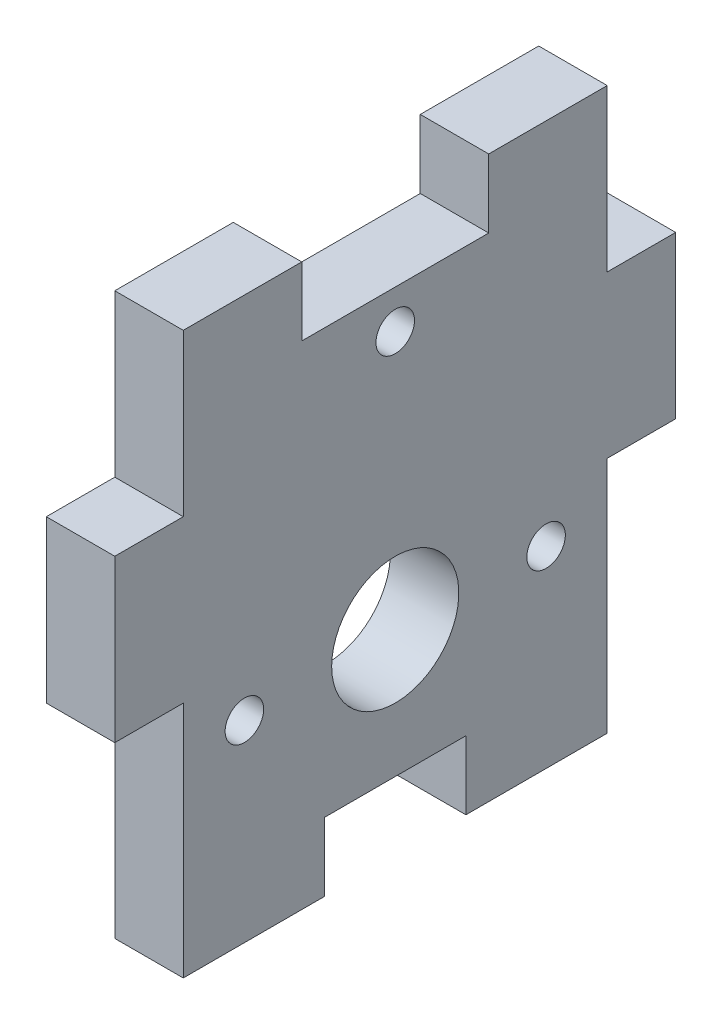
ISO-10303-21;
HEADER;
FILE_DESCRIPTION(('STEP AP214'),'2;1');
FILE_NAME('part.step','',(''),(''),'','','');
FILE_SCHEMA(('AUTOMOTIVE_DESIGN { 1 0 10303 214 1 1 1 1 }'));
ENDSEC;
DATA;
#1=APPLICATION_CONTEXT('core data for automotive mechanical design processes');
#2=APPLICATION_PROTOCOL_DEFINITION('international standard','automotive_design',2000,#1);
#3=PRODUCT_CONTEXT('',#1,'mechanical');
#4=PRODUCT('Part','Part','',(#3));
#5=PRODUCT_RELATED_PRODUCT_CATEGORY('part','',(#4));
#6=PRODUCT_DEFINITION_FORMATION('','',#4);
#7=PRODUCT_DEFINITION_CONTEXT('part definition',#1,'design');
#8=PRODUCT_DEFINITION('design','',#6,#7);
#9=PRODUCT_DEFINITION_SHAPE('','',#8);
#10=(LENGTH_UNIT() NAMED_UNIT(*) SI_UNIT(.MILLI.,.METRE.));
#11=(NAMED_UNIT(*) PLANE_ANGLE_UNIT() SI_UNIT($,.RADIAN.));
#12=(NAMED_UNIT(*) SI_UNIT($,.STERADIAN.) SOLID_ANGLE_UNIT());
#13=UNCERTAINTY_MEASURE_WITH_UNIT(LENGTH_MEASURE(1.E-05),#10,'distance_accuracy_value','');
#14=(GEOMETRIC_REPRESENTATION_CONTEXT(3) GLOBAL_UNCERTAINTY_ASSIGNED_CONTEXT((#13)) GLOBAL_UNIT_ASSIGNED_CONTEXT((#10,
#11,#12)) REPRESENTATION_CONTEXT('',''));
#15=CARTESIAN_POINT('',(0.,0.,0.));
#16=DIRECTION('',(0.,0.,1.));
#17=DIRECTION('',(1.,0.,0.));
#18=AXIS2_PLACEMENT_3D('',#15,#16,#17);
#19=CARTESIAN_POINT('',(5.334,16.51,-16.51));
#20=DIRECTION('',(-1.,0.,0.));
#21=DIRECTION('',(0.,0.,1.));
#22=AXIS2_PLACEMENT_3D('',#19,#20,#21);
#23=PLANE('',#22);
#24=CARTESIAN_POINT('',(5.334,-6.84159698893422,-11.75));
#25=DIRECTION('',(-1.,0.,0.));
#26=DIRECTION('',(0.,0.,1.));
#27=AXIS2_PLACEMENT_3D('',#24,#25,#26);
#28=CIRCLE('',#27,1.50000000000001);
#29=CARTESIAN_POINT('',(5.334,-6.84159698893422,-10.2499999999999));
#30=VERTEX_POINT('',#29);
#31=EDGE_CURVE('E540',#30,#30,#28,.T.);
#32=ORIENTED_EDGE('',*,*,#31,.T.);
#33=EDGE_LOOP('',(#32));
#34=FACE_BOUND('',#33,.T.);
#35=CARTESIAN_POINT('',(5.334,-6.60399999999996,0.));
#36=DIRECTION('',(-1.,0.,0.));
#37=DIRECTION('',(0.,0.,1.));
#38=AXIS2_PLACEMENT_3D('',#35,#36,#37);
#39=CIRCLE('',#38,4.95300000000001);
#40=CARTESIAN_POINT('',(5.334,-6.60399999999996,4.95300000000006));
#41=VERTEX_POINT('',#40);
#42=EDGE_CURVE('E544',#41,#41,#39,.T.);
#43=ORIENTED_EDGE('',*,*,#42,.T.);
#44=EDGE_LOOP('',(#43));
#45=FACE_BOUND('',#44,.T.);
#46=CARTESIAN_POINT('',(5.334,-6.84159698893422,11.7500000000001));
#47=DIRECTION('',(-1.,0.,0.));
#48=DIRECTION('',(0.,0.,1.));
#49=AXIS2_PLACEMENT_3D('',#46,#47,#48);
#50=CIRCLE('',#49,1.50000000000001);
#51=CARTESIAN_POINT('',(5.334,-6.84159698893422,13.2500000000001));
#52=VERTEX_POINT('',#51);
#53=EDGE_CURVE('E553',#52,#52,#50,.T.);
#54=ORIENTED_EDGE('',*,*,#53,.T.);
#55=EDGE_LOOP('',(#54));
#56=FACE_BOUND('',#55,.T.);
#57=CARTESIAN_POINT('',(5.334,13.5100000000001,0.));
#58=DIRECTION('',(-1.,0.,0.));
#59=DIRECTION('',(0.,0.,1.));
#60=AXIS2_PLACEMENT_3D('',#57,#58,#59);
#61=CIRCLE('',#60,1.50000000000001);
#62=CARTESIAN_POINT('',(5.334,13.5100000000001,1.50000000000005));
#63=VERTEX_POINT('',#62);
#64=EDGE_CURVE('E231',#63,#63,#61,.T.);
#65=ORIENTED_EDGE('',*,*,#64,.T.);
#66=EDGE_LOOP('',(#65));
#67=FACE_BOUND('',#66,.T.);
#68=DIRECTION('',(0.,0.,-1.));
#69=VECTOR('',#68,1.);
#70=CARTESIAN_POINT('',(5.33400000000003,16.51,7.28133333333334));
#71=LINE('',#70,#69);
#72=CARTESIAN_POINT('',(5.33400000000003,16.51,7.28133333333334));
#73=VERTEX_POINT('',#72);
#74=CARTESIAN_POINT('',(5.33400000000002,16.51,-7.28133333333333));
#75=VERTEX_POINT('',#74);
#76=EDGE_CURVE('E274',#73,#75,#71,.T.);
#77=ORIENTED_EDGE('',*,*,#76,.F.);
#78=DIRECTION('',(0.,1.,0.));
#79=VECTOR('',#78,1.);
#80=CARTESIAN_POINT('',(5.33400000000003,16.51,7.28133333333334));
#81=LINE('',#80,#79);
#82=CARTESIAN_POINT('',(5.33400000000003,21.844,7.28133333333334));
#83=VERTEX_POINT('',#82);
#84=EDGE_CURVE('E299',#73,#83,#81,.T.);
#85=ORIENTED_EDGE('',*,*,#84,.T.);
#86=DIRECTION('',(0.,0.,1.));
#87=VECTOR('',#86,1.);
#88=CARTESIAN_POINT('',(5.334,21.844,-48.1982213562373));
#89=LINE('',#88,#87);
#90=CARTESIAN_POINT('',(5.334,21.844,16.51));
#91=VERTEX_POINT('',#90);
#92=EDGE_CURVE('E370',#83,#91,#89,.T.);
#93=ORIENTED_EDGE('',*,*,#92,.T.);
#94=DIRECTION('',(0.,1.,0.));
#95=VECTOR('',#94,1.);
#96=CARTESIAN_POINT('',(5.334,-15.875,16.51));
#97=LINE('',#96,#95);
#98=CARTESIAN_POINT('',(5.334,9.271,16.51));
#99=VERTEX_POINT('',#98);
#100=EDGE_CURVE('E89',#99,#91,#97,.T.);
#101=ORIENTED_EDGE('',*,*,#100,.F.);
#102=DIRECTION('',(0.,0.,1.));
#103=VECTOR('',#102,1.);
#104=CARTESIAN_POINT('',(5.334,9.271,16.51));
#105=LINE('',#104,#103);
#106=CARTESIAN_POINT('',(5.334,9.271,21.844));
#107=VERTEX_POINT('',#106);
#108=EDGE_CURVE('E238',#99,#107,#105,.T.);
#109=ORIENTED_EDGE('',*,*,#108,.T.);
#110=DIRECTION('',(0.,1.,0.));
#111=VECTOR('',#110,1.);
#112=CARTESIAN_POINT('',(5.334,0.,21.844));
#113=LINE('',#112,#111);
#114=CARTESIAN_POINT('',(5.334,-3.302,21.844));
#115=VERTEX_POINT('',#114);
#116=EDGE_CURVE('E237',#115,#107,#113,.T.);
#117=ORIENTED_EDGE('',*,*,#116,.F.);
#118=DIRECTION('',(0.,0.,-1.));
#119=VECTOR('',#118,1.);
#120=CARTESIAN_POINT('',(5.334,-3.302,16.51));
#121=LINE('',#120,#119);
#122=CARTESIAN_POINT('',(5.334,-3.302,16.51));
#123=VERTEX_POINT('',#122);
#124=EDGE_CURVE('E226',#115,#123,#121,.T.);
#125=ORIENTED_EDGE('',*,*,#124,.T.);
#126=DIRECTION('',(0.,-1.,0.));
#127=VECTOR('',#126,1.);
#128=CARTESIAN_POINT('',(5.334,0.,16.51));
#129=LINE('',#128,#127);
#130=CARTESIAN_POINT('',(5.334,-21.844,16.51));
#131=VERTEX_POINT('',#130);
#132=EDGE_CURVE('E210',#123,#131,#129,.T.);
#133=ORIENTED_EDGE('',*,*,#132,.T.);
#134=DIRECTION('',(0.,0.,-1.));
#135=VECTOR('',#134,1.);
#136=CARTESIAN_POINT('',(5.334,-21.844,-48.1982213562373));
#137=LINE('',#136,#135);
#138=CARTESIAN_POINT('',(5.334,-21.844,5.50333333333335));
#139=VERTEX_POINT('',#138);
#140=EDGE_CURVE('E330',#131,#139,#137,.T.);
#141=ORIENTED_EDGE('',*,*,#140,.T.);
#142=DIRECTION('',(0.,-1.,0.));
#143=VECTOR('',#142,1.);
#144=CARTESIAN_POINT('',(5.334,-21.844,5.50333333333335));
#145=LINE('',#144,#143);
#146=CARTESIAN_POINT('',(5.334,-16.51,5.50333333333335));
#147=VERTEX_POINT('',#146);
#148=EDGE_CURVE('E307',#147,#139,#145,.T.);
#149=ORIENTED_EDGE('',*,*,#148,.F.);
#150=DIRECTION('',(0.,0.,1.));
#151=VECTOR('',#150,1.);
#152=CARTESIAN_POINT('',(5.334,-16.51,5.50333333333335));
#153=LINE('',#152,#151);
#154=CARTESIAN_POINT('',(5.334,-16.51,-5.50333333333332));
#155=VERTEX_POINT('',#154);
#156=EDGE_CURVE('E312',#155,#147,#153,.T.);
#157=ORIENTED_EDGE('',*,*,#156,.F.);
#158=DIRECTION('',(0.,1.,0.));
#159=VECTOR('',#158,1.);
#160=CARTESIAN_POINT('',(5.334,-21.844,-5.50333333333332));
#161=LINE('',#160,#159);
#162=CARTESIAN_POINT('',(5.334,-21.844,-5.50333333333332));
#163=VERTEX_POINT('',#162);
#164=EDGE_CURVE('E309',#163,#155,#161,.T.);
#165=ORIENTED_EDGE('',*,*,#164,.F.);
#166=CARTESIAN_POINT('',(5.334,-21.844,-16.51));
#167=VERTEX_POINT('',#166);
#168=EDGE_CURVE('E220',#163,#167,#137,.T.);
#169=ORIENTED_EDGE('',*,*,#168,.T.);
#170=DIRECTION('',(0.,-1.,0.));
#171=VECTOR('',#170,1.);
#172=CARTESIAN_POINT('',(5.334,0.,-16.51));
#173=LINE('',#172,#171);
#174=CARTESIAN_POINT('',(5.33399999999999,-3.30200000000001,-16.51));
#175=VERTEX_POINT('',#174);
#176=EDGE_CURVE('E323',#175,#167,#173,.T.);
#177=ORIENTED_EDGE('',*,*,#176,.F.);
#178=DIRECTION('',(0.,0.,-1.));
#179=VECTOR('',#178,1.);
#180=CARTESIAN_POINT('',(5.33399999999999,-3.30200000000001,-21.844));
#181=LINE('',#180,#179);
#182=CARTESIAN_POINT('',(5.33399999999999,-3.30200000000001,-21.844));
#183=VERTEX_POINT('',#182);
#184=EDGE_CURVE('E267',#175,#183,#181,.T.);
#185=ORIENTED_EDGE('',*,*,#184,.T.);
#186=DIRECTION('',(0.,-1.,0.));
#187=VECTOR('',#186,1.);
#188=CARTESIAN_POINT('',(5.334,0.,-21.844));
#189=LINE('',#188,#187);
#190=CARTESIAN_POINT('',(5.334,9.27099999999999,-21.844));
#191=VERTEX_POINT('',#190);
#192=EDGE_CURVE('E332',#191,#183,#189,.T.);
#193=ORIENTED_EDGE('',*,*,#192,.F.);
#194=DIRECTION('',(0.,0.,1.));
#195=VECTOR('',#194,1.);
#196=CARTESIAN_POINT('',(5.33399999999999,9.27099999999999,-21.844));
#197=LINE('',#196,#195);
#198=CARTESIAN_POINT('',(5.33399999999999,9.27099999999999,-16.51));
#199=VERTEX_POINT('',#198);
#200=EDGE_CURVE('E270',#191,#199,#197,.T.);
#201=ORIENTED_EDGE('',*,*,#200,.T.);
#202=DIRECTION('',(0.,1.,0.));
#203=VECTOR('',#202,1.);
#204=CARTESIAN_POINT('',(5.33399999999999,-15.875,-16.51));
#205=LINE('',#204,#203);
#206=CARTESIAN_POINT('',(5.33399999999998,21.844,-16.51));
#207=VERTEX_POINT('',#206);
#208=EDGE_CURVE('E261',#199,#207,#205,.T.);
#209=ORIENTED_EDGE('',*,*,#208,.T.);
#210=CARTESIAN_POINT('',(5.334,21.844,-7.28133333333333));
#211=VERTEX_POINT('',#210);
#212=EDGE_CURVE('E369',#207,#211,#89,.T.);
#213=ORIENTED_EDGE('',*,*,#212,.T.);
#214=DIRECTION('',(0.,1.,0.));
#215=VECTOR('',#214,1.);
#216=CARTESIAN_POINT('',(5.33400000000002,16.51,-7.28133333333333));
#217=LINE('',#216,#215);
#218=EDGE_CURVE('E97',#75,#211,#217,.T.);
#219=ORIENTED_EDGE('',*,*,#218,.F.);
#220=EDGE_LOOP('',(#77,#85,#93,#101,#109,#117,#125,#133,#141,#149,#157,#165,#169,#177,#185,#193,
#201,#209,#213,#219));
#221=FACE_BOUND('',#220,.T.);
#222=ADVANCED_FACE('F73',(#34,#45,#56,#67,#221),#23,.F.);
#223=CARTESIAN_POINT('',(0.,16.51,-16.51));
#224=DIRECTION('',(-1.,0.,0.));
#225=DIRECTION('',(0.,0.,1.));
#226=AXIS2_PLACEMENT_3D('',#223,#224,#225);
#227=PLANE('',#226);
#228=CARTESIAN_POINT('',(0.,-6.84159698893422,-11.75));
#229=DIRECTION('',(-1.,0.,0.));
#230=DIRECTION('',(0.,0.,1.));
#231=AXIS2_PLACEMENT_3D('',#228,#229,#230);
#232=CIRCLE('',#231,1.50000000000001);
#233=CARTESIAN_POINT('',(0.,-6.84159698893422,-10.2499999999999));
#234=VERTEX_POINT('',#233);
#235=EDGE_CURVE('E538',#234,#234,#232,.T.);
#236=ORIENTED_EDGE('',*,*,#235,.F.);
#237=EDGE_LOOP('',(#236));
#238=FACE_BOUND('',#237,.T.);
#239=CARTESIAN_POINT('',(0.,-6.60399999999996,0.));
#240=DIRECTION('',(-1.,0.,0.));
#241=DIRECTION('',(0.,0.,1.));
#242=AXIS2_PLACEMENT_3D('',#239,#240,#241);
#243=CIRCLE('',#242,4.95300000000001);
#244=CARTESIAN_POINT('',(0.,-6.60399999999996,4.95300000000006));
#245=VERTEX_POINT('',#244);
#246=EDGE_CURVE('E541',#245,#245,#243,.T.);
#247=ORIENTED_EDGE('',*,*,#246,.F.);
#248=EDGE_LOOP('',(#247));
#249=FACE_BOUND('',#248,.T.);
#250=CARTESIAN_POINT('',(0.,-6.84159698893422,11.7500000000001));
#251=DIRECTION('',(-1.,0.,0.));
#252=DIRECTION('',(0.,0.,1.));
#253=AXIS2_PLACEMENT_3D('',#250,#251,#252);
#254=CIRCLE('',#253,1.50000000000001);
#255=CARTESIAN_POINT('',(0.,-6.84159698893422,13.2500000000001));
#256=VERTEX_POINT('',#255);
#257=EDGE_CURVE('E550',#256,#256,#254,.T.);
#258=ORIENTED_EDGE('',*,*,#257,.F.);
#259=EDGE_LOOP('',(#258));
#260=FACE_BOUND('',#259,.T.);
#261=CARTESIAN_POINT('',(0.,13.5100000000001,0.));
#262=DIRECTION('',(-1.,0.,0.));
#263=DIRECTION('',(0.,0.,1.));
#264=AXIS2_PLACEMENT_3D('',#261,#262,#263);
#265=CIRCLE('',#264,1.50000000000001);
#266=CARTESIAN_POINT('',(0.,13.5100000000001,1.50000000000005));
#267=VERTEX_POINT('',#266);
#268=EDGE_CURVE('E556',#267,#267,#265,.T.);
#269=ORIENTED_EDGE('',*,*,#268,.F.);
#270=EDGE_LOOP('',(#269));
#271=FACE_BOUND('',#270,.T.);
#272=DIRECTION('',(0.,1.,0.));
#273=VECTOR('',#272,1.);
#274=CARTESIAN_POINT('',(0.,0.,21.844));
#275=LINE('',#274,#273);
#276=CARTESIAN_POINT('',(0.,-3.30200000000001,21.844));
#277=VERTEX_POINT('',#276);
#278=CARTESIAN_POINT('',(0.,9.27099999999999,21.844));
#279=VERTEX_POINT('',#278);
#280=EDGE_CURVE('E342',#277,#279,#275,.T.);
#281=ORIENTED_EDGE('',*,*,#280,.T.);
#282=DIRECTION('',(0.,0.,-1.));
#283=VECTOR('',#282,1.);
#284=CARTESIAN_POINT('',(0.,9.27099999999999,21.84405));
#285=LINE('',#284,#283);
#286=CARTESIAN_POINT('',(0.,9.27099999999999,16.51));
#287=VERTEX_POINT('',#286);
#288=EDGE_CURVE('E421',#279,#287,#285,.T.);
#289=ORIENTED_EDGE('',*,*,#288,.T.);
#290=DIRECTION('',(0.,-1.,0.));
#291=VECTOR('',#290,1.);
#292=CARTESIAN_POINT('',(0.,21.844,16.51));
#293=LINE('',#292,#291);
#294=CARTESIAN_POINT('',(0.,21.844,16.51));
#295=VERTEX_POINT('',#294);
#296=EDGE_CURVE('E287',#295,#287,#293,.T.);
#297=ORIENTED_EDGE('',*,*,#296,.F.);
#298=DIRECTION('',(0.,0.,1.));
#299=VECTOR('',#298,1.);
#300=CARTESIAN_POINT('',(0.,21.844,-48.1982213562373));
#301=LINE('',#300,#299);
#302=CARTESIAN_POINT('',(0.,21.844,7.28133333333334));
#303=VERTEX_POINT('',#302);
#304=EDGE_CURVE('E339',#303,#295,#301,.T.);
#305=ORIENTED_EDGE('',*,*,#304,.F.);
#306=DIRECTION('',(0.,1.,0.));
#307=VECTOR('',#306,1.);
#308=CARTESIAN_POINT('',(0.,16.51,7.28133333333334));
#309=LINE('',#308,#307);
#310=CARTESIAN_POINT('',(0.,16.51,7.28133333333334));
#311=VERTEX_POINT('',#310);
#312=EDGE_CURVE('E284',#311,#303,#309,.T.);
#313=ORIENTED_EDGE('',*,*,#312,.F.);
#314=DIRECTION('',(0.,0.,1.));
#315=VECTOR('',#314,1.);
#316=CARTESIAN_POINT('',(0.,16.51,-16.51));
#317=LINE('',#316,#315);
#318=CARTESIAN_POINT('',(0.,16.51,-7.28133333333333));
#319=VERTEX_POINT('',#318);
#320=EDGE_CURVE('E12',#319,#311,#317,.T.);
#321=ORIENTED_EDGE('',*,*,#320,.F.);
#322=DIRECTION('',(0.,1.,0.));
#323=VECTOR('',#322,1.);
#324=CARTESIAN_POINT('',(0.,16.51,-7.28133333333333));
#325=LINE('',#324,#323);
#326=CARTESIAN_POINT('',(0.,21.844,-7.28133333333333));
#327=VERTEX_POINT('',#326);
#328=EDGE_CURVE('E288',#319,#327,#325,.T.);
#329=ORIENTED_EDGE('',*,*,#328,.T.);
#330=CARTESIAN_POINT('',(0.,21.844,-16.51));
#331=VERTEX_POINT('',#330);
#332=EDGE_CURVE('E347',#331,#327,#301,.T.);
#333=ORIENTED_EDGE('',*,*,#332,.F.);
#334=DIRECTION('',(0.,1.,0.));
#335=VECTOR('',#334,1.);
#336=CARTESIAN_POINT('',(0.,16.51,-16.51));
#337=LINE('',#336,#335);
#338=CARTESIAN_POINT('',(0.,9.27099999999999,-16.51));
#339=VERTEX_POINT('',#338);
#340=EDGE_CURVE('E305',#339,#331,#337,.T.);
#341=ORIENTED_EDGE('',*,*,#340,.F.);
#342=DIRECTION('',(0.,0.,-1.));
#343=VECTOR('',#342,1.);
#344=CARTESIAN_POINT('',(0.,9.27099999999999,-16.50995));
#345=LINE('',#344,#343);
#346=CARTESIAN_POINT('',(0.,9.27099999999999,-21.844));
#347=VERTEX_POINT('',#346);
#348=EDGE_CURVE('E252',#339,#347,#345,.T.);
#349=ORIENTED_EDGE('',*,*,#348,.T.);
#350=DIRECTION('',(0.,-1.,0.));
#351=VECTOR('',#350,1.);
#352=CARTESIAN_POINT('',(0.,0.,-21.844));
#353=LINE('',#352,#351);
#354=CARTESIAN_POINT('',(0.,-3.30200000000001,-21.844));
#355=VERTEX_POINT('',#354);
#356=EDGE_CURVE('E336',#347,#355,#353,.T.);
#357=ORIENTED_EDGE('',*,*,#356,.T.);
#358=DIRECTION('',(0.,0.,-1.));
#359=VECTOR('',#358,1.);
#360=CARTESIAN_POINT('',(0.,-3.30200000000001,-16.50995));
#361=LINE('',#360,#359);
#362=CARTESIAN_POINT('',(0.,-3.30200000000001,-16.51));
#363=VERTEX_POINT('',#362);
#364=EDGE_CURVE('E251',#363,#355,#361,.T.);
#365=ORIENTED_EDGE('',*,*,#364,.F.);
#366=DIRECTION('',(0.,-1.,0.));
#367=VECTOR('',#366,1.);
#368=CARTESIAN_POINT('',(0.,0.,-16.51));
#369=LINE('',#368,#367);
#370=CARTESIAN_POINT('',(0.,-21.844,-16.51));
#371=VERTEX_POINT('',#370);
#372=EDGE_CURVE('E221',#363,#371,#369,.T.);
#373=ORIENTED_EDGE('',*,*,#372,.T.);
#374=DIRECTION('',(0.,0.,-1.));
#375=VECTOR('',#374,1.);
#376=CARTESIAN_POINT('',(0.,-21.844,-48.1982213562373));
#377=LINE('',#376,#375);
#378=CARTESIAN_POINT('',(0.,-21.844,-5.50333333333332));
#379=VERTEX_POINT('',#378);
#380=EDGE_CURVE('E335',#379,#371,#377,.T.);
#381=ORIENTED_EDGE('',*,*,#380,.F.);
#382=DIRECTION('',(0.,-1.,0.));
#383=VECTOR('',#382,1.);
#384=CARTESIAN_POINT('',(0.,16.51,-5.50333333333332));
#385=LINE('',#384,#383);
#386=CARTESIAN_POINT('',(0.,-16.51,-5.50333333333332));
#387=VERTEX_POINT('',#386);
#388=EDGE_CURVE('E318',#387,#379,#385,.T.);
#389=ORIENTED_EDGE('',*,*,#388,.F.);
#390=DIRECTION('',(0.,0.,-1.));
#391=VECTOR('',#390,1.);
#392=CARTESIAN_POINT('',(0.,-16.51,-16.51));
#393=LINE('',#392,#391);
#394=CARTESIAN_POINT('',(0.,-16.51,5.50333333333335));
#395=VERTEX_POINT('',#394);
#396=EDGE_CURVE('E82',#395,#387,#393,.T.);
#397=ORIENTED_EDGE('',*,*,#396,.F.);
#398=DIRECTION('',(0.,1.,0.));
#399=VECTOR('',#398,1.);
#400=CARTESIAN_POINT('',(0.,16.51,5.50333333333335));
#401=LINE('',#400,#399);
#402=CARTESIAN_POINT('',(0.,-21.844,5.50333333333335));
#403=VERTEX_POINT('',#402);
#404=EDGE_CURVE('E321',#403,#395,#401,.T.);
#405=ORIENTED_EDGE('',*,*,#404,.F.);
#406=CARTESIAN_POINT('',(0.,-21.844,16.51));
#407=VERTEX_POINT('',#406);
#408=EDGE_CURVE('E329',#407,#403,#377,.T.);
#409=ORIENTED_EDGE('',*,*,#408,.F.);
#410=DIRECTION('',(0.,-1.,0.));
#411=VECTOR('',#410,1.);
#412=CARTESIAN_POINT('',(0.,0.,16.51));
#413=LINE('',#412,#411);
#414=CARTESIAN_POINT('',(0.,-3.30200000000001,16.51));
#415=VERTEX_POINT('',#414);
#416=EDGE_CURVE('E325',#415,#407,#413,.T.);
#417=ORIENTED_EDGE('',*,*,#416,.F.);
#418=DIRECTION('',(0.,0.,-1.));
#419=VECTOR('',#418,1.);
#420=CARTESIAN_POINT('',(0.,-3.30200000000001,21.84405));
#421=LINE('',#420,#419);
#422=EDGE_CURVE('E229',#277,#415,#421,.T.);
#423=ORIENTED_EDGE('',*,*,#422,.F.);
#424=EDGE_LOOP('',(#281,#289,#297,#305,#313,#321,#329,#333,#341,#349,#357,#365,#373,#381,#389,
#397,#405,#409,#417,#423));
#425=FACE_BOUND('',#424,.T.);
#426=ADVANCED_FACE('F75',(#238,#249,#260,#271,#425),#227,.T.);
#427=CARTESIAN_POINT('',(0.,0.,21.844));
#428=DIRECTION('',(0.,0.,-1.));
#429=DIRECTION('',(-1.,0.,0.));
#430=AXIS2_PLACEMENT_3D('',#427,#428,#429);
#431=PLANE('',#430);
#432=DIRECTION('',(-1.,0.,0.));
#433=VECTOR('',#432,1.);
#434=CARTESIAN_POINT('',(-63.5,9.27099999999997,21.844));
#435=LINE('',#434,#433);
#436=EDGE_CURVE('E427',#107,#279,#435,.T.);
#437=ORIENTED_EDGE('',*,*,#436,.T.);
#438=ORIENTED_EDGE('',*,*,#280,.F.);
#439=DIRECTION('',(1.,0.,0.));
#440=VECTOR('',#439,1.);
#441=CARTESIAN_POINT('',(-63.5,-3.30200000000003,21.844));
#442=LINE('',#441,#440);
#443=EDGE_CURVE('E425',#277,#115,#442,.T.);
#444=ORIENTED_EDGE('',*,*,#443,.T.);
#445=ORIENTED_EDGE('',*,*,#116,.T.);
#446=EDGE_LOOP('',(#437,#438,#444,#445));
#447=FACE_BOUND('',#446,.T.);
#448=ADVANCED_FACE('F432',(#447),#431,.F.);
#449=CARTESIAN_POINT('',(0.,21.844,-48.1982213562373));
#450=DIRECTION('',(0.,1.,0.));
#451=DIRECTION('',(0.,0.,1.));
#452=AXIS2_PLACEMENT_3D('',#449,#450,#451);
#453=PLANE('',#452);
#454=DIRECTION('',(1.,0.,0.));
#455=VECTOR('',#454,1.);
#456=CARTESIAN_POINT('',(0.,21.844,7.28133333333334));
#457=LINE('',#456,#455);
#458=EDGE_CURVE('E273',#303,#83,#457,.T.);
#459=ORIENTED_EDGE('',*,*,#458,.F.);
#460=ORIENTED_EDGE('',*,*,#304,.T.);
#461=DIRECTION('',(-1.,0.,0.));
#462=VECTOR('',#461,1.);
#463=CARTESIAN_POINT('',(0.,21.844,16.51));
#464=LINE('',#463,#462);
#465=EDGE_CURVE('E239',#91,#295,#464,.T.);
#466=ORIENTED_EDGE('',*,*,#465,.F.);
#467=ORIENTED_EDGE('',*,*,#92,.F.);
#468=EDGE_LOOP('',(#459,#460,#466,#467));
#469=FACE_BOUND('',#468,.T.);
#470=ADVANCED_FACE('F434',(#469),#453,.T.);
#471=DIRECTION('',(-1.,0.,0.));
#472=VECTOR('',#471,1.);
#473=CARTESIAN_POINT('',(0.,21.844,-7.28133333333333));
#474=LINE('',#473,#472);
#475=EDGE_CURVE('E293',#211,#327,#474,.T.);
#476=ORIENTED_EDGE('',*,*,#475,.F.);
#477=ORIENTED_EDGE('',*,*,#212,.F.);
#478=DIRECTION('',(-1.,0.,0.));
#479=VECTOR('',#478,1.);
#480=CARTESIAN_POINT('',(0.,21.844,-16.51));
#481=LINE('',#480,#479);
#482=EDGE_CURVE('E264',#207,#331,#481,.T.);
#483=ORIENTED_EDGE('',*,*,#482,.T.);
#484=ORIENTED_EDGE('',*,*,#332,.T.);
#485=EDGE_LOOP('',(#476,#477,#483,#484));
#486=FACE_BOUND('',#485,.T.);
#487=ADVANCED_FACE('F397',(#486),#453,.T.);
#488=CARTESIAN_POINT('',(0.,0.,-21.844));
#489=DIRECTION('',(0.,0.,1.));
#490=DIRECTION('',(0.,-1.,0.));
#491=AXIS2_PLACEMENT_3D('',#488,#489,#490);
#492=PLANE('',#491);
#493=DIRECTION('',(1.,0.,0.));
#494=VECTOR('',#493,1.);
#495=CARTESIAN_POINT('',(5.33399999999999,9.27099999999999,-21.844));
#496=LINE('',#495,#494);
#497=EDGE_CURVE('E248',#347,#191,#496,.T.);
#498=ORIENTED_EDGE('',*,*,#497,.T.);
#499=ORIENTED_EDGE('',*,*,#192,.T.);
#500=DIRECTION('',(-1.,0.,0.));
#501=VECTOR('',#500,1.);
#502=CARTESIAN_POINT('',(5.33399999999999,-3.30200000000001,-21.844));
#503=LINE('',#502,#501);
#504=EDGE_CURVE('E241',#183,#355,#503,.T.);
#505=ORIENTED_EDGE('',*,*,#504,.T.);
#506=ORIENTED_EDGE('',*,*,#356,.F.);
#507=EDGE_LOOP('',(#498,#499,#505,#506));
#508=FACE_BOUND('',#507,.T.);
#509=ADVANCED_FACE('F375',(#508),#492,.F.);
#510=CARTESIAN_POINT('',(0.,-21.844,-48.1982213562373));
#511=DIRECTION('',(0.,-1.,0.));
#512=DIRECTION('',(0.,0.,-1.));
#513=AXIS2_PLACEMENT_3D('',#510,#511,#512);
#514=PLANE('',#513);
#515=DIRECTION('',(-1.,0.,0.));
#516=VECTOR('',#515,1.);
#517=CARTESIAN_POINT('',(0.,-21.844,5.50333333333335));
#518=LINE('',#517,#516);
#519=EDGE_CURVE('E351',#139,#403,#518,.T.);
#520=ORIENTED_EDGE('',*,*,#519,.F.);
#521=ORIENTED_EDGE('',*,*,#140,.F.);
#522=DIRECTION('',(1.,0.,0.));
#523=VECTOR('',#522,1.);
#524=CARTESIAN_POINT('',(0.,-21.844,16.51));
#525=LINE('',#524,#523);
#526=EDGE_CURVE('E215',#407,#131,#525,.T.);
#527=ORIENTED_EDGE('',*,*,#526,.F.);
#528=ORIENTED_EDGE('',*,*,#408,.T.);
#529=EDGE_LOOP('',(#520,#521,#527,#528));
#530=FACE_BOUND('',#529,.T.);
#531=ADVANCED_FACE('F453',(#530),#514,.T.);
#532=CARTESIAN_POINT('',(0.,0.,-16.51));
#533=DIRECTION('',(0.,0.,1.));
#534=DIRECTION('',(1.,0.,0.));
#535=AXIS2_PLACEMENT_3D('',#532,#533,#534);
#536=PLANE('',#535);
#537=ORIENTED_EDGE('',*,*,#176,.T.);
#538=DIRECTION('',(1.,0.,0.));
#539=VECTOR('',#538,1.);
#540=CARTESIAN_POINT('',(0.,-21.844,-16.51));
#541=LINE('',#540,#539);
#542=EDGE_CURVE('E326',#371,#167,#541,.T.);
#543=ORIENTED_EDGE('',*,*,#542,.F.);
#544=ORIENTED_EDGE('',*,*,#372,.F.);
#545=DIRECTION('',(1.,0.,0.));
#546=VECTOR('',#545,1.);
#547=CARTESIAN_POINT('',(-63.5,-3.30200000000002,-16.51));
#548=LINE('',#547,#546);
#549=EDGE_CURVE('E255',#363,#175,#548,.T.);
#550=ORIENTED_EDGE('',*,*,#549,.T.);
#551=EDGE_LOOP('',(#537,#543,#544,#550));
#552=FACE_BOUND('',#551,.T.);
#553=ADVANCED_FACE('F458',(#552),#536,.F.);
#554=DIRECTION('',(1.,0.,0.));
#555=VECTOR('',#554,1.);
#556=CARTESIAN_POINT('',(0.,-21.844,-5.50333333333332));
#557=LINE('',#556,#555);
#558=EDGE_CURVE('E353',#379,#163,#557,.T.);
#559=ORIENTED_EDGE('',*,*,#558,.F.);
#560=ORIENTED_EDGE('',*,*,#380,.T.);
#561=ORIENTED_EDGE('',*,*,#542,.T.);
#562=ORIENTED_EDGE('',*,*,#168,.F.);
#563=EDGE_LOOP('',(#559,#560,#561,#562));
#564=FACE_BOUND('',#563,.T.);
#565=ADVANCED_FACE('F461',(#564),#514,.T.);
#566=CARTESIAN_POINT('',(0.,0.,16.51));
#567=DIRECTION('',(0.,0.,1.));
#568=DIRECTION('',(1.,0.,0.));
#569=AXIS2_PLACEMENT_3D('',#566,#567,#568);
#570=PLANE('',#569);
#571=ORIENTED_EDGE('',*,*,#132,.F.);
#572=DIRECTION('',(-1.,0.,0.));
#573=VECTOR('',#572,1.);
#574=CARTESIAN_POINT('',(5.334,-3.302,16.51));
#575=LINE('',#574,#573);
#576=EDGE_CURVE('E214',#123,#415,#575,.T.);
#577=ORIENTED_EDGE('',*,*,#576,.T.);
#578=ORIENTED_EDGE('',*,*,#416,.T.);
#579=ORIENTED_EDGE('',*,*,#526,.T.);
#580=EDGE_LOOP('',(#571,#577,#578,#579));
#581=FACE_BOUND('',#580,.T.);
#582=ADVANCED_FACE('F212',(#581),#570,.T.);
#583=CARTESIAN_POINT('',(-4.99999999997031E-05,-21.844,5.50333333333335));
#584=DIRECTION('',(0.,0.,1.));
#585=DIRECTION('',(1.,0.,0.));
#586=AXIS2_PLACEMENT_3D('',#583,#584,#585);
#587=PLANE('',#586);
#588=ORIENTED_EDGE('',*,*,#404,.T.);
#589=DIRECTION('',(1.,0.,0.));
#590=VECTOR('',#589,1.);
#591=CARTESIAN_POINT('',(-4.99999999997031E-05,-16.51,5.50333333333335));
#592=LINE('',#591,#590);
#593=EDGE_CURVE('E316',#395,#147,#592,.T.);
#594=ORIENTED_EDGE('',*,*,#593,.T.);
#595=ORIENTED_EDGE('',*,*,#148,.T.);
#596=ORIENTED_EDGE('',*,*,#519,.T.);
#597=EDGE_LOOP('',(#588,#594,#595,#596));
#598=FACE_BOUND('',#597,.T.);
#599=ADVANCED_FACE('F475',(#598),#587,.F.);
#600=CARTESIAN_POINT('',(-4.99999999997031E-05,-16.51,5.50333333333335));
#601=DIRECTION('',(0.,1.,0.));
#602=DIRECTION('',(0.,0.,1.));
#603=AXIS2_PLACEMENT_3D('',#600,#601,#602);
#604=PLANE('',#603);
#605=ORIENTED_EDGE('',*,*,#396,.T.);
#606=DIRECTION('',(1.,0.,0.));
#607=VECTOR('',#606,1.);
#608=CARTESIAN_POINT('',(-4.99999999997031E-05,-16.51,-5.50333333333332));
#609=LINE('',#608,#607);
#610=EDGE_CURVE('E315',#387,#155,#609,.T.);
#611=ORIENTED_EDGE('',*,*,#610,.T.);
#612=ORIENTED_EDGE('',*,*,#156,.T.);
#613=ORIENTED_EDGE('',*,*,#593,.F.);
#614=EDGE_LOOP('',(#605,#611,#612,#613));
#615=FACE_BOUND('',#614,.T.);
#616=ADVANCED_FACE('F487',(#615),#604,.F.);
#617=CARTESIAN_POINT('',(-4.99999999997031E-05,-21.844,-5.50333333333332));
#618=DIRECTION('',(0.,0.,-1.));
#619=DIRECTION('',(-1.,0.,0.));
#620=AXIS2_PLACEMENT_3D('',#617,#618,#619);
#621=PLANE('',#620);
#622=ORIENTED_EDGE('',*,*,#388,.T.);
#623=ORIENTED_EDGE('',*,*,#558,.T.);
#624=ORIENTED_EDGE('',*,*,#164,.T.);
#625=ORIENTED_EDGE('',*,*,#610,.F.);
#626=EDGE_LOOP('',(#622,#623,#624,#625));
#627=FACE_BOUND('',#626,.T.);
#628=ADVANCED_FACE('F484',(#627),#621,.F.);
#629=CARTESIAN_POINT('',(5.334,-3.302,21.84405));
#630=DIRECTION('',(0.,-1.,0.));
#631=DIRECTION('',(-1.,0.,0.));
#632=AXIS2_PLACEMENT_3D('',#629,#630,#631);
#633=PLANE('',#632);
#634=ORIENTED_EDGE('',*,*,#443,.F.);
#635=ORIENTED_EDGE('',*,*,#422,.T.);
#636=ORIENTED_EDGE('',*,*,#576,.F.);
#637=ORIENTED_EDGE('',*,*,#124,.F.);
#638=EDGE_LOOP('',(#634,#635,#636,#637));
#639=FACE_BOUND('',#638,.T.);
#640=ADVANCED_FACE('F225',(#639),#633,.T.);
#641=CARTESIAN_POINT('',(5.33399999999999,-3.30200000000001,-16.50995));
#642=DIRECTION('',(0.,-1.,0.));
#643=DIRECTION('',(-1.,0.,0.));
#644=AXIS2_PLACEMENT_3D('',#641,#642,#643);
#645=PLANE('',#644);
#646=ORIENTED_EDGE('',*,*,#549,.F.);
#647=ORIENTED_EDGE('',*,*,#364,.T.);
#648=ORIENTED_EDGE('',*,*,#504,.F.);
#649=ORIENTED_EDGE('',*,*,#184,.F.);
#650=EDGE_LOOP('',(#646,#647,#648,#649));
#651=FACE_BOUND('',#650,.T.);
#652=ADVANCED_FACE('F380',(#651),#645,.T.);
#653=CARTESIAN_POINT('',(5.33399999999999,9.27099999999999,-16.50995));
#654=DIRECTION('',(0.,1.,0.));
#655=DIRECTION('',(1.,0.,0.));
#656=AXIS2_PLACEMENT_3D('',#653,#654,#655);
#657=PLANE('',#656);
#658=DIRECTION('',(-1.,0.,0.));
#659=VECTOR('',#658,1.);
#660=CARTESIAN_POINT('',(-63.5,9.27099999999998,-16.51));
#661=LINE('',#660,#659);
#662=EDGE_CURVE('E259',#199,#339,#661,.T.);
#663=ORIENTED_EDGE('',*,*,#662,.F.);
#664=ORIENTED_EDGE('',*,*,#200,.F.);
#665=ORIENTED_EDGE('',*,*,#497,.F.);
#666=ORIENTED_EDGE('',*,*,#348,.F.);
#667=EDGE_LOOP('',(#663,#664,#665,#666));
#668=FACE_BOUND('',#667,.T.);
#669=ADVANCED_FACE('F390',(#668),#657,.T.);
#670=CARTESIAN_POINT('',(-63.5,16.51,-16.51));
#671=DIRECTION('',(0.,0.,1.));
#672=DIRECTION('',(1.,0.,0.));
#673=AXIS2_PLACEMENT_3D('',#670,#671,#672);
#674=PLANE('',#673);
#675=ORIENTED_EDGE('',*,*,#340,.T.);
#676=ORIENTED_EDGE('',*,*,#482,.F.);
#677=ORIENTED_EDGE('',*,*,#208,.F.);
#678=ORIENTED_EDGE('',*,*,#662,.T.);
#679=EDGE_LOOP('',(#675,#676,#677,#678));
#680=FACE_BOUND('',#679,.T.);
#681=ADVANCED_FACE('F393',(#680),#674,.F.);
#682=CARTESIAN_POINT('',(-63.5,16.51,16.51));
#683=DIRECTION('',(0.,0.,1.));
#684=DIRECTION('',(1.,0.,0.));
#685=AXIS2_PLACEMENT_3D('',#682,#683,#684);
#686=PLANE('',#685);
#687=DIRECTION('',(1.,0.,0.));
#688=VECTOR('',#687,1.);
#689=CARTESIAN_POINT('',(5.334,9.271,16.51));
#690=LINE('',#689,#688);
#691=EDGE_CURVE('E230',#287,#99,#690,.T.);
#692=ORIENTED_EDGE('',*,*,#691,.T.);
#693=ORIENTED_EDGE('',*,*,#100,.T.);
#694=ORIENTED_EDGE('',*,*,#465,.T.);
#695=ORIENTED_EDGE('',*,*,#296,.T.);
#696=EDGE_LOOP('',(#692,#693,#694,#695));
#697=FACE_BOUND('',#696,.T.);
#698=ADVANCED_FACE('F415',(#697),#686,.T.);
#699=CARTESIAN_POINT('',(5.334,9.271,21.84405));
#700=DIRECTION('',(0.,1.,0.));
#701=DIRECTION('',(1.,0.,0.));
#702=AXIS2_PLACEMENT_3D('',#699,#700,#701);
#703=PLANE('',#702);
#704=ORIENTED_EDGE('',*,*,#436,.F.);
#705=ORIENTED_EDGE('',*,*,#108,.F.);
#706=ORIENTED_EDGE('',*,*,#691,.F.);
#707=ORIENTED_EDGE('',*,*,#288,.F.);
#708=EDGE_LOOP('',(#704,#705,#706,#707));
#709=FACE_BOUND('',#708,.T.);
#710=ADVANCED_FACE('F420',(#709),#703,.T.);
#711=CARTESIAN_POINT('',(-38.1,16.51,-16.51));
#712=DIRECTION('',(0.,-1.,0.));
#713=DIRECTION('',(-1.,0.,0.));
#714=AXIS2_PLACEMENT_3D('',#711,#712,#713);
#715=PLANE('',#714);
#716=ORIENTED_EDGE('',*,*,#320,.T.);
#717=DIRECTION('',(1.,0.,0.));
#718=VECTOR('',#717,1.);
#719=CARTESIAN_POINT('',(0.,16.51,7.28133333333334));
#720=LINE('',#719,#718);
#721=EDGE_CURVE('E278',#311,#73,#720,.T.);
#722=ORIENTED_EDGE('',*,*,#721,.T.);
#723=ORIENTED_EDGE('',*,*,#76,.T.);
#724=DIRECTION('',(-1.,0.,0.));
#725=VECTOR('',#724,1.);
#726=CARTESIAN_POINT('',(0.,16.51,-7.28133333333333));
#727=LINE('',#726,#725);
#728=EDGE_CURVE('E277',#75,#319,#727,.T.);
#729=ORIENTED_EDGE('',*,*,#728,.T.);
#730=EDGE_LOOP('',(#716,#722,#723,#729));
#731=FACE_BOUND('',#730,.T.);
#732=ADVANCED_FACE('F405',(#731),#715,.F.);
#733=CARTESIAN_POINT('',(0.,16.51,7.28133333333334));
#734=DIRECTION('',(0.,0.,1.));
#735=DIRECTION('',(1.,0.,0.));
#736=AXIS2_PLACEMENT_3D('',#733,#734,#735);
#737=PLANE('',#736);
#738=ORIENTED_EDGE('',*,*,#458,.T.);
#739=ORIENTED_EDGE('',*,*,#84,.F.);
#740=ORIENTED_EDGE('',*,*,#721,.F.);
#741=ORIENTED_EDGE('',*,*,#312,.T.);
#742=EDGE_LOOP('',(#738,#739,#740,#741));
#743=FACE_BOUND('',#742,.T.);
#744=ADVANCED_FACE('F407',(#743),#737,.F.);
#745=CARTESIAN_POINT('',(0.,16.51,-7.28133333333333));
#746=DIRECTION('',(0.,0.,-1.));
#747=DIRECTION('',(-1.,0.,0.));
#748=AXIS2_PLACEMENT_3D('',#745,#746,#747);
#749=PLANE('',#748);
#750=ORIENTED_EDGE('',*,*,#475,.T.);
#751=ORIENTED_EDGE('',*,*,#328,.F.);
#752=ORIENTED_EDGE('',*,*,#728,.F.);
#753=ORIENTED_EDGE('',*,*,#218,.T.);
#754=EDGE_LOOP('',(#750,#751,#752,#753));
#755=FACE_BOUND('',#754,.T.);
#756=ADVANCED_FACE('F399',(#755),#749,.F.);
#757=CARTESIAN_POINT('',(5.33402500000003,13.5100000000001,0.));
#758=DIRECTION('',(-1.,0.,0.));
#759=DIRECTION('',(0.,0.,1.));
#760=AXIS2_PLACEMENT_3D('',#757,#758,#759);
#761=CYLINDRICAL_SURFACE('',#760,1.50000000000001);
#762=ORIENTED_EDGE('',*,*,#268,.T.);
#763=EDGE_LOOP('',(#762));
#764=FACE_BOUND('',#763,.T.);
#765=ORIENTED_EDGE('',*,*,#64,.F.);
#766=EDGE_LOOP('',(#765));
#767=FACE_BOUND('',#766,.T.);
#768=ADVANCED_FACE('F506',(#764,#767),#761,.F.);
#769=CARTESIAN_POINT('',(5.33402500000003,-6.84159698893422,11.7500000000001));
#770=DIRECTION('',(-1.,0.,0.));
#771=DIRECTION('',(0.,0.,1.));
#772=AXIS2_PLACEMENT_3D('',#769,#770,#771);
#773=CYLINDRICAL_SURFACE('',#772,1.50000000000001);
#774=ORIENTED_EDGE('',*,*,#257,.T.);
#775=EDGE_LOOP('',(#774));
#776=FACE_BOUND('',#775,.T.);
#777=ORIENTED_EDGE('',*,*,#53,.F.);
#778=EDGE_LOOP('',(#777));
#779=FACE_BOUND('',#778,.T.);
#780=ADVANCED_FACE('F521',(#776,#779),#773,.F.);
#781=CARTESIAN_POINT('',(5.33402500000003,-6.60399999999996,0.));
#782=DIRECTION('',(-1.,0.,0.));
#783=DIRECTION('',(0.,0.,1.));
#784=AXIS2_PLACEMENT_3D('',#781,#782,#783);
#785=CYLINDRICAL_SURFACE('',#784,4.95300000000001);
#786=ORIENTED_EDGE('',*,*,#246,.T.);
#787=EDGE_LOOP('',(#786));
#788=FACE_BOUND('',#787,.T.);
#789=ORIENTED_EDGE('',*,*,#42,.F.);
#790=EDGE_LOOP('',(#789));
#791=FACE_BOUND('',#790,.T.);
#792=ADVANCED_FACE('F525',(#788,#791),#785,.F.);
#793=CARTESIAN_POINT('',(5.33402500000003,-6.84159698893422,-11.75));
#794=DIRECTION('',(-1.,0.,0.));
#795=DIRECTION('',(0.,0.,1.));
#796=AXIS2_PLACEMENT_3D('',#793,#794,#795);
#797=CYLINDRICAL_SURFACE('',#796,1.50000000000001);
#798=ORIENTED_EDGE('',*,*,#235,.T.);
#799=EDGE_LOOP('',(#798));
#800=FACE_BOUND('',#799,.T.);
#801=ORIENTED_EDGE('',*,*,#31,.F.);
#802=EDGE_LOOP('',(#801));
#803=FACE_BOUND('',#802,.T.);
#804=ADVANCED_FACE('F529',(#800,#803),#797,.F.);
#805=CLOSED_SHELL('',(#222,#426,#448,#470,#487,#509,#531,#553,#565,#582,#599,#616,#628,#640,
#652,#669,#681,#698,#710,#732,#744,#756,#768,#780,#792,#804));
#806=MANIFOLD_SOLID_BREP('B2',#805);
#807=ADVANCED_BREP_SHAPE_REPRESENTATION('',(#18,#806),#14);
#808=SHAPE_DEFINITION_REPRESENTATION(#9,#807);
ENDSEC;
END-ISO-10303-21;
